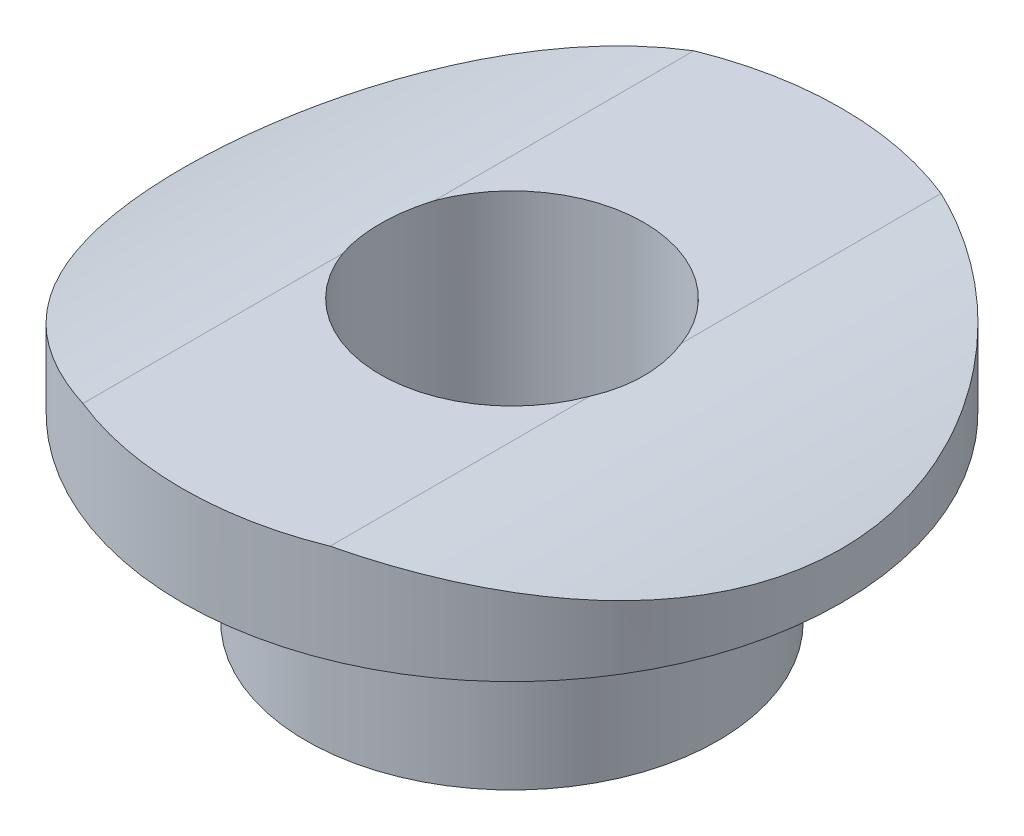
ISO-10303-21;
HEADER;
FILE_DESCRIPTION(('STEP AP214'),'2;1');
FILE_NAME('part.step','',(''),(''),'','','');
FILE_SCHEMA(('AUTOMOTIVE_DESIGN { 1 0 10303 214 1 1 1 1 }'));
ENDSEC;
DATA;
#1=APPLICATION_CONTEXT('core data for automotive mechanical design processes');
#2=APPLICATION_PROTOCOL_DEFINITION('international standard','automotive_design',2000,#1);
#3=PRODUCT_CONTEXT('',#1,'mechanical');
#4=PRODUCT('Part','Part','',(#3));
#5=PRODUCT_RELATED_PRODUCT_CATEGORY('part','',(#4));
#6=PRODUCT_DEFINITION_FORMATION('','',#4);
#7=PRODUCT_DEFINITION_CONTEXT('part definition',#1,'design');
#8=PRODUCT_DEFINITION('design','',#6,#7);
#9=PRODUCT_DEFINITION_SHAPE('','',#8);
#10=(LENGTH_UNIT() NAMED_UNIT(*) SI_UNIT(.MILLI.,.METRE.));
#11=(NAMED_UNIT(*) PLANE_ANGLE_UNIT() SI_UNIT($,.RADIAN.));
#12=(NAMED_UNIT(*) SI_UNIT($,.STERADIAN.) SOLID_ANGLE_UNIT());
#13=UNCERTAINTY_MEASURE_WITH_UNIT(LENGTH_MEASURE(1.E-05),#10,'distance_accuracy_value','');
#14=(GEOMETRIC_REPRESENTATION_CONTEXT(3) GLOBAL_UNCERTAINTY_ASSIGNED_CONTEXT((#13)) GLOBAL_UNIT_ASSIGNED_CONTEXT((#10,
#11,#12)) REPRESENTATION_CONTEXT('',''));
#15=CARTESIAN_POINT('',(0.,0.,0.));
#16=DIRECTION('',(0.,0.,1.));
#17=DIRECTION('',(1.,0.,0.));
#18=AXIS2_PLACEMENT_3D('',#15,#16,#17);
#19=CARTESIAN_POINT('',(0.,0.,0.));
#20=DIRECTION('',(0.,-1.,0.));
#21=DIRECTION('',(0.,0.,-1.));
#22=AXIS2_PLACEMENT_3D('',#19,#20,#21);
#23=CYLINDRICAL_SURFACE('',#22,2.032);
#24=CARTESIAN_POINT('',(0.,0.,0.));
#25=DIRECTION('',(0.,-1.,0.));
#26=DIRECTION('',(0.,0.,-1.));
#27=AXIS2_PLACEMENT_3D('',#24,#25,#26);
#28=CIRCLE('',#27,2.032);
#29=CARTESIAN_POINT('',(0.,0.,-2.032));
#30=VERTEX_POINT('',#29);
#31=EDGE_CURVE('E100',#30,#30,#28,.T.);
#32=ORIENTED_EDGE('',*,*,#31,.T.);
#33=EDGE_LOOP('',(#32));
#34=FACE_BOUND('',#33,.T.);
#35=CARTESIAN_POINT('',(1.90499999999998,4.318,-0.707106074079463));
#36=CARTESIAN_POINT('',(1.92468280374587,4.31536248048454,-0.654076763898529));
#37=CARTESIAN_POINT('',(1.94214605436232,4.31298373032241,-0.600239481785232));
#38=CARTESIAN_POINT('',(1.97253031626523,4.30880097945918,-0.491275480734784));
#39=CARTESIAN_POINT('',(1.98545124783558,4.30699698884496,-0.436148739186172));
#40=CARTESIAN_POINT('',(2.01725914555737,4.30253110728005,-0.269252392804479));
#41=CARTESIAN_POINT('',(2.02916454372759,4.3008189969169,-0.156038641740171));
#42=CARTESIAN_POINT('',(2.0339416193369,4.30013530733765,0.0708074424447846));
#43=CARTESIAN_POINT('',(2.02679888879729,4.30116580262357,0.184440027459384));
#44=CARTESIAN_POINT('',(1.99369467011447,4.30584958324624,0.408626439772084));
#45=CARTESIAN_POINT('',(1.96778773793012,4.30949526476803,0.519188229743194));
#46=CARTESIAN_POINT('',(1.92420082705816,4.31541750222743,0.653676040711907));
#47=CARTESIAN_POINT('',(1.91487884846346,4.31667615233868,0.680502680148397));
#48=CARTESIAN_POINT('',(1.90499999999998,4.318,0.707106074079463));
#49=B_SPLINE_CURVE_WITH_KNOTS('',3,(#35,#36,#37,#38,#39,#40,#41,#42,#43,#44,#45,#46,#47,#48),
.UNSPECIFIED.,.F.,.F.,(4,2,2,2,2,2,4),(0.,0.169773390697426,0.339549760710467,0.679330121992686,
1.01936756556252,1.35842031600887,1.44367590802857),.UNSPECIFIED.);
#50=CARTESIAN_POINT('',(1.90499999999998,4.318,-0.707106074079463));
#51=VERTEX_POINT('',#50);
#52=CARTESIAN_POINT('',(1.90499999999998,4.318,0.707106074079464));
#53=VERTEX_POINT('',#52);
#54=EDGE_CURVE('E74',#51,#53,#49,.T.);
#55=ORIENTED_EDGE('',*,*,#54,.F.);
#56=CARTESIAN_POINT('',(0.,4.318,0.));
#57=DIRECTION('',(0.,-1.,0.));
#58=DIRECTION('',(0.,0.,-1.));
#59=AXIS2_PLACEMENT_3D('',#56,#57,#58);
#60=CIRCLE('',#59,2.032);
#61=CARTESIAN_POINT('',(-1.90499999999998,4.318,-0.707106074079464));
#62=VERTEX_POINT('',#61);
#63=EDGE_CURVE('E120',#62,#51,#60,.T.);
#64=ORIENTED_EDGE('',*,*,#63,.F.);
#65=CARTESIAN_POINT('',(-1.90499999999998,4.318,0.707106074079463));
#66=CARTESIAN_POINT('',(-1.92468280374587,4.31536248048454,0.654076763898529));
#67=CARTESIAN_POINT('',(-1.94214605436232,4.31298373032241,0.600239481785232));
#68=CARTESIAN_POINT('',(-1.97253031626523,4.30880097945918,0.491275480734784));
#69=CARTESIAN_POINT('',(-1.98545124783558,4.30699698884496,0.436148739186172));
#70=CARTESIAN_POINT('',(-2.01725914555737,4.30253110728005,0.269252392804479));
#71=CARTESIAN_POINT('',(-2.02916454372759,4.3008189969169,0.156038641740171));
#72=CARTESIAN_POINT('',(-2.0339416193369,4.30013530733765,-0.0708074424447846));
#73=CARTESIAN_POINT('',(-2.02679888879729,4.30116580262357,-0.184440027459384));
#74=CARTESIAN_POINT('',(-1.99369467011447,4.30584958324624,-0.408626439772084));
#75=CARTESIAN_POINT('',(-1.96778773793012,4.30949526476803,-0.519188229743194));
#76=CARTESIAN_POINT('',(-1.92420082705816,4.31541750222743,-0.653676040711907));
#77=CARTESIAN_POINT('',(-1.91487884846346,4.31667615233868,-0.680502680148397));
#78=CARTESIAN_POINT('',(-1.90499999999998,4.318,-0.707106074079463));
#79=B_SPLINE_CURVE_WITH_KNOTS('',3,(#65,#66,#67,#68,#69,#70,#71,#72,#73,#74,#75,#76,#77,#78),
.UNSPECIFIED.,.F.,.F.,(4,2,2,2,2,2,4),(0.,0.169773390697426,0.339549760710467,0.679330121992686,
1.01936756556252,1.35842031600887,1.44367590802857),.UNSPECIFIED.);
#80=CARTESIAN_POINT('',(-1.90499999999998,4.318,0.707106074079463));
#81=VERTEX_POINT('',#80);
#82=EDGE_CURVE('E67',#81,#62,#79,.T.);
#83=ORIENTED_EDGE('',*,*,#82,.F.);
#84=EDGE_CURVE('E114',#53,#81,#60,.T.);
#85=ORIENTED_EDGE('',*,*,#84,.F.);
#86=EDGE_LOOP('',(#55,#64,#83,#85));
#87=FACE_BOUND('',#86,.T.);
#88=ADVANCED_FACE('F51',(#34,#87),#23,.F.);
#89=CARTESIAN_POINT('',(0.,0.,0.));
#90=DIRECTION('',(0.,-1.,0.));
#91=DIRECTION('',(0.,0.,-1.));
#92=AXIS2_PLACEMENT_3D('',#89,#90,#91);
#93=CYLINDRICAL_SURFACE('',#92,5.08);
#94=CARTESIAN_POINT('',(0.,2.794,0.));
#95=DIRECTION('',(0.,-1.,0.));
#96=DIRECTION('',(0.,0.,-1.));
#97=AXIS2_PLACEMENT_3D('',#94,#95,#96);
#98=CIRCLE('',#97,5.08);
#99=CARTESIAN_POINT('',(0.,2.794,-5.08));
#100=VERTEX_POINT('',#99);
#101=EDGE_CURVE('E118',#100,#100,#98,.T.);
#102=ORIENTED_EDGE('',*,*,#101,.F.);
#103=EDGE_LOOP('',(#102));
#104=FACE_BOUND('',#103,.T.);
#105=CARTESIAN_POINT('',(1.90499999999998,4.318,4.70928603930575));
#106=CARTESIAN_POINT('',(2.03903667969095,4.30006177793964,4.6550778977629));
#107=CARTESIAN_POINT('',(2.17054123721565,4.28050811513206,4.59521121756992));
#108=CARTESIAN_POINT('',(2.42762275183672,4.23877657144714,4.46472741078724));
#109=CARTESIAN_POINT('',(2.5532014392052,4.21659946329542,4.39411344802024));
#110=CARTESIAN_POINT('',(2.79752810439003,4.17023911773298,4.24274323526789));
#111=CARTESIAN_POINT('',(2.9162826399775,4.14605786273545,4.16199696800147));
#112=CARTESIAN_POINT('',(3.14633966757798,4.09634312461087,3.99092954699728));
#113=CARTESIAN_POINT('',(3.25764169321642,4.07080955703548,3.90060779494221));
#114=CARTESIAN_POINT('',(3.57920320939398,3.99324398906486,3.6162684171993));
#115=CARTESIAN_POINT('',(3.77747767566447,3.94017571221332,3.40865310250046));
#116=CARTESIAN_POINT('',(4.13657144510587,3.83718148651851,2.96264398311337));
#117=CARTESIAN_POINT('',(4.29738470758164,3.78725604540977,2.72424522415242));
#118=CARTESIAN_POINT('',(4.57866441801997,3.69580870577338,2.21957516435603));
#119=CARTESIAN_POINT('',(4.6986682951404,3.65438513508646,1.9530264741257));
#120=CARTESIAN_POINT('',(4.89152005742993,3.58602864323014,1.40165494620108));
#121=CARTESIAN_POINT('',(4.96438952340127,3.55908909141185,1.11684053733641));
#122=CARTESIAN_POINT('',(5.05756313025242,3.52436171603635,0.552375525300156));
#123=CARTESIAN_POINT('',(5.08032818837416,3.51567826653354,0.273186436913899));
#124=CARTESIAN_POINT('',(5.07966483357338,3.51593076403133,-0.28509483415444));
#125=CARTESIAN_POINT('',(5.05624626164081,3.52486295742133,-0.564187024809562));
#126=CARTESIAN_POINT('',(4.96609931801238,3.55844155208552,-1.1026389792522));
#127=CARTESIAN_POINT('',(4.90114809621265,3.5824424435153,-1.36234106681154));
#128=CARTESIAN_POINT('',(4.73194874211682,3.64272178077546,-1.86706217618957));
#129=CARTESIAN_POINT('',(4.62769701286369,3.67900135037395,-2.11207985164594));
#130=CARTESIAN_POINT('',(4.37879867886377,3.76129867239987,-2.58991158606701));
#131=CARTESIAN_POINT('',(4.23287666409112,3.80761048960784,-2.82200782870113));
#132=CARTESIAN_POINT('',(3.90596021530326,3.90427255949954,-3.25951617355728));
#133=CARTESIAN_POINT('',(3.72493472776384,3.95462636455443,-3.46490437834497));
#134=CARTESIAN_POINT('',(3.42499091082858,4.03071881079313,-3.75455523520295));
#135=CARTESIAN_POINT('',(3.31701073551321,4.05687397237243,-3.85028330293088));
#136=CARTESIAN_POINT('',(3.09316490436248,4.10816040017171,-4.03230816726997));
#137=CARTESIAN_POINT('',(2.97730209817658,4.13329203121079,-4.11860834306679));
#138=CARTESIAN_POINT('',(2.73865694486141,4.18178773623427,-4.28099952043123));
#139=CARTESIAN_POINT('',(2.61588953117569,4.20515538688807,-4.35711143631233));
#140=CARTESIAN_POINT('',(2.36403768420495,4.24952338799088,-4.49872985361908));
#141=CARTESIAN_POINT('',(2.23495670380526,4.27052501210889,-4.56424206939363));
#142=CARTESIAN_POINT('',(2.03775559018694,4.299743714764,-4.65393684524195));
#143=CARTESIAN_POINT('',(1.97168350705387,4.30907143396539,-4.6823142294754));
#144=CARTESIAN_POINT('',(1.90499999999998,4.318,-4.70928603930575));
#145=B_SPLINE_CURVE_WITH_KNOTS('',3,(#105,#106,#107,#108,#109,#110,#111,#112,#113,#114,#115,
#116,#117,#118,#119,#120,#121,#122,#123,#124,#125,#126,#127,#128,#129,#130,#131,#132,#133,#134,
#135,#136,#137,#138,#139,#140,#141,#142,#143,#144),.UNSPECIFIED.,.F.,.F.,(4,2,2,2,2,2,2,2,2,2,2,
2,2,2,2,2,2,2,2,4),(0.,0.436897475580579,0.873666583636317,1.310008700559,1.74637809809413,
2.61784469036652,3.48945171127074,4.37063245558511,5.25140945934249,6.08785908446504,
6.92413049486237,7.72681616719873,8.52957532273734,9.36017173431382,10.1915062948372,
10.6310389405339,11.0704135265651,11.5088718670745,11.9470930392798,12.1645541887048),.UNSPECIFIED.);
#146=CARTESIAN_POINT('',(1.90499999999998,4.318,4.70928603930575));
#147=VERTEX_POINT('',#146);
#148=CARTESIAN_POINT('',(1.90499999999998,4.318,-4.70928603930575));
#149=VERTEX_POINT('',#148);
#150=EDGE_CURVE('E175',#147,#149,#145,.T.);
#151=ORIENTED_EDGE('',*,*,#150,.F.);
#152=CARTESIAN_POINT('',(0.,4.318,0.));
#153=DIRECTION('',(0.,-1.,0.));
#154=DIRECTION('',(0.,0.,-1.));
#155=AXIS2_PLACEMENT_3D('',#152,#153,#154);
#156=CIRCLE('',#155,5.08);
#157=CARTESIAN_POINT('',(-1.90499999999998,4.318,4.70928603930575));
#158=VERTEX_POINT('',#157);
#159=EDGE_CURVE('E108',#147,#158,#156,.T.);
#160=ORIENTED_EDGE('',*,*,#159,.T.);
#161=CARTESIAN_POINT('',(-1.90499999999998,4.318,-4.70928603930575));
#162=CARTESIAN_POINT('',(-2.03903667969095,4.30006177793964,-4.6550778977629));
#163=CARTESIAN_POINT('',(-2.17054123721565,4.28050811513206,-4.59521121756992));
#164=CARTESIAN_POINT('',(-2.42762275183672,4.23877657144714,-4.46472741078724));
#165=CARTESIAN_POINT('',(-2.5532014392052,4.21659946329542,-4.39411344802024));
#166=CARTESIAN_POINT('',(-2.79752810439003,4.17023911773298,-4.24274323526789));
#167=CARTESIAN_POINT('',(-2.9162826399775,4.14605786273545,-4.16199696800147));
#168=CARTESIAN_POINT('',(-3.14633966757798,4.09634312461087,-3.99092954699728));
#169=CARTESIAN_POINT('',(-3.25764169321642,4.07080955703548,-3.90060779494221));
#170=CARTESIAN_POINT('',(-3.57920320939398,3.99324398906486,-3.6162684171993));
#171=CARTESIAN_POINT('',(-3.77747767566447,3.94017571221332,-3.40865310250046));
#172=CARTESIAN_POINT('',(-4.13657144510587,3.83718148651851,-2.96264398311337));
#173=CARTESIAN_POINT('',(-4.29738470758164,3.78725604540977,-2.72424522415242));
#174=CARTESIAN_POINT('',(-4.57866441801997,3.69580870577338,-2.21957516435603));
#175=CARTESIAN_POINT('',(-4.6986682951404,3.65438513508646,-1.9530264741257));
#176=CARTESIAN_POINT('',(-4.89152005742993,3.58602864323014,-1.40165494620108));
#177=CARTESIAN_POINT('',(-4.96438952340127,3.55908909141185,-1.11684053733641));
#178=CARTESIAN_POINT('',(-5.05756313025242,3.52436171603635,-0.552375525300156));
#179=CARTESIAN_POINT('',(-5.08032818837416,3.51567826653354,-0.273186436913899));
#180=CARTESIAN_POINT('',(-5.07966483357338,3.51593076403133,0.28509483415444));
#181=CARTESIAN_POINT('',(-5.05624626164081,3.52486295742133,0.564187024809562));
#182=CARTESIAN_POINT('',(-4.96609931801238,3.55844155208552,1.1026389792522));
#183=CARTESIAN_POINT('',(-4.90114809621265,3.5824424435153,1.36234106681154));
#184=CARTESIAN_POINT('',(-4.73194874211682,3.64272178077546,1.86706217618957));
#185=CARTESIAN_POINT('',(-4.62769701286369,3.67900135037395,2.11207985164594));
#186=CARTESIAN_POINT('',(-4.37879867886377,3.76129867239987,2.58991158606701));
#187=CARTESIAN_POINT('',(-4.23287666409112,3.80761048960784,2.82200782870113));
#188=CARTESIAN_POINT('',(-3.90596021530326,3.90427255949954,3.25951617355728));
#189=CARTESIAN_POINT('',(-3.72493472776384,3.95462636455443,3.46490437834497));
#190=CARTESIAN_POINT('',(-3.42499091082858,4.03071881079313,3.75455523520295));
#191=CARTESIAN_POINT('',(-3.31701073551321,4.05687397237243,3.85028330293088));
#192=CARTESIAN_POINT('',(-3.09316490436248,4.10816040017171,4.03230816726997));
#193=CARTESIAN_POINT('',(-2.97730209817658,4.13329203121079,4.11860834306679));
#194=CARTESIAN_POINT('',(-2.73865694486141,4.18178773623427,4.28099952043123));
#195=CARTESIAN_POINT('',(-2.61588953117569,4.20515538688807,4.35711143631233));
#196=CARTESIAN_POINT('',(-2.36403768420495,4.24952338799088,4.49872985361908));
#197=CARTESIAN_POINT('',(-2.23495670380526,4.27052501210889,4.56424206939363));
#198=CARTESIAN_POINT('',(-2.03775559018694,4.299743714764,4.65393684524195));
#199=CARTESIAN_POINT('',(-1.97168350705387,4.30907143396539,4.6823142294754));
#200=CARTESIAN_POINT('',(-1.90499999999998,4.318,4.70928603930575));
#201=B_SPLINE_CURVE_WITH_KNOTS('',3,(#161,#162,#163,#164,#165,#166,#167,#168,#169,#170,#171,
#172,#173,#174,#175,#176,#177,#178,#179,#180,#181,#182,#183,#184,#185,#186,#187,#188,#189,#190,
#191,#192,#193,#194,#195,#196,#197,#198,#199,#200),.UNSPECIFIED.,.F.,.F.,(4,2,2,2,2,2,2,2,2,2,2,
2,2,2,2,2,2,2,2,4),(0.,0.436897475580579,0.873666583636317,1.310008700559,1.74637809809413,
2.61784469036652,3.48945171127074,4.37063245558511,5.25140945934249,6.08785908446504,
6.92413049486237,7.72681616719873,8.52957532273734,9.36017173431382,10.1915062948372,
10.6310389405339,11.0704135265651,11.5088718670745,11.9470930392798,12.1645541887048),.UNSPECIFIED.);
#202=CARTESIAN_POINT('',(-1.90499999999998,4.318,-4.70928603930575));
#203=VERTEX_POINT('',#202);
#204=EDGE_CURVE('E92',#203,#158,#201,.T.);
#205=ORIENTED_EDGE('',*,*,#204,.F.);
#206=EDGE_CURVE('E106',#203,#149,#156,.T.);
#207=ORIENTED_EDGE('',*,*,#206,.T.);
#208=EDGE_LOOP('',(#151,#160,#205,#207));
#209=FACE_BOUND('',#208,.T.);
#210=ADVANCED_FACE('F105',(#104,#209),#93,.T.);
#211=CARTESIAN_POINT('',(-5.08,4.318,0.));
#212=DIRECTION('',(0.,-1.,0.));
#213=DIRECTION('',(0.,0.,-1.));
#214=AXIS2_PLACEMENT_3D('',#211,#212,#213);
#215=PLANE('',#214);
#216=DIRECTION('',(0.,0.,1.));
#217=VECTOR('',#216,1.);
#218=CARTESIAN_POINT('',(1.90499999999998,4.318,-5.08));
#219=LINE('',#218,#217);
#220=EDGE_CURVE('E12',#149,#51,#219,.T.);
#221=ORIENTED_EDGE('',*,*,#220,.F.);
#222=ORIENTED_EDGE('',*,*,#206,.F.);
#223=DIRECTION('',(0.,0.,1.));
#224=VECTOR('',#223,1.);
#225=CARTESIAN_POINT('',(-1.90499999999998,4.318,-5.08));
#226=LINE('',#225,#224);
#227=EDGE_CURVE('E89',#62,#203,#226,.F.);
#228=ORIENTED_EDGE('',*,*,#227,.F.);
#229=ORIENTED_EDGE('',*,*,#63,.T.);
#230=EDGE_LOOP('',(#221,#222,#228,#229));
#231=FACE_BOUND('',#230,.T.);
#232=ADVANCED_FACE('F112',(#231),#215,.F.);
#233=EDGE_CURVE('E55',#53,#147,#219,.T.);
#234=ORIENTED_EDGE('',*,*,#233,.F.);
#235=ORIENTED_EDGE('',*,*,#84,.T.);
#236=EDGE_CURVE('E99',#158,#81,#226,.F.);
#237=ORIENTED_EDGE('',*,*,#236,.F.);
#238=ORIENTED_EDGE('',*,*,#159,.F.);
#239=EDGE_LOOP('',(#234,#235,#237,#238));
#240=FACE_BOUND('',#239,.T.);
#241=ADVANCED_FACE('F145',(#240),#215,.F.);
#242=CARTESIAN_POINT('',(-2.032,0.,0.));
#243=DIRECTION('',(0.,1.,0.));
#244=DIRECTION('',(0.,0.,1.));
#245=AXIS2_PLACEMENT_3D('',#242,#243,#244);
#246=PLANE('',#245);
#247=ORIENTED_EDGE('',*,*,#31,.F.);
#248=EDGE_LOOP('',(#247));
#249=FACE_BOUND('',#248,.T.);
#250=CARTESIAN_POINT('',(0.,0.,0.));
#251=DIRECTION('',(0.,-1.,0.));
#252=DIRECTION('',(0.,0.,-1.));
#253=AXIS2_PLACEMENT_3D('',#250,#251,#252);
#254=CIRCLE('',#253,3.175);
#255=CARTESIAN_POINT('',(0.,0.,-3.175));
#256=VERTEX_POINT('',#255);
#257=EDGE_CURVE('E131',#256,#256,#254,.T.);
#258=ORIENTED_EDGE('',*,*,#257,.T.);
#259=EDGE_LOOP('',(#258));
#260=FACE_BOUND('',#259,.T.);
#261=ADVANCED_FACE('F141',(#249,#260),#246,.F.);
#262=CARTESIAN_POINT('',(0.,0.,0.));
#263=DIRECTION('',(0.,-1.,0.));
#264=DIRECTION('',(0.,0.,-1.));
#265=AXIS2_PLACEMENT_3D('',#262,#263,#264);
#266=CYLINDRICAL_SURFACE('',#265,3.175);
#267=ORIENTED_EDGE('',*,*,#257,.F.);
#268=EDGE_LOOP('',(#267));
#269=FACE_BOUND('',#268,.T.);
#270=CARTESIAN_POINT('',(0.,2.794,0.));
#271=DIRECTION('',(0.,-1.,0.));
#272=DIRECTION('',(0.,0.,-1.));
#273=AXIS2_PLACEMENT_3D('',#270,#271,#272);
#274=CIRCLE('',#273,3.175);
#275=CARTESIAN_POINT('',(0.,2.794,-3.175));
#276=VERTEX_POINT('',#275);
#277=EDGE_CURVE('E127',#276,#276,#274,.T.);
#278=ORIENTED_EDGE('',*,*,#277,.T.);
#279=EDGE_LOOP('',(#278));
#280=FACE_BOUND('',#279,.T.);
#281=ADVANCED_FACE('F144',(#269,#280),#266,.T.);
#282=CARTESIAN_POINT('',(-3.175,2.794,0.));
#283=DIRECTION('',(0.,1.,0.));
#284=DIRECTION('',(0.,0.,1.));
#285=AXIS2_PLACEMENT_3D('',#282,#283,#284);
#286=PLANE('',#285);
#287=ORIENTED_EDGE('',*,*,#277,.F.);
#288=EDGE_LOOP('',(#287));
#289=FACE_BOUND('',#288,.T.);
#290=ORIENTED_EDGE('',*,*,#101,.T.);
#291=EDGE_LOOP('',(#290));
#292=FACE_BOUND('',#291,.T.);
#293=ADVANCED_FACE('F150',(#289,#292),#286,.F.);
#294=CARTESIAN_POINT('',(0.,-9.906,-5.08));
#295=DIRECTION('',(0.,0.,1.));
#296=DIRECTION('',(1.,0.,0.));
#297=AXIS2_PLACEMENT_3D('',#294,#295,#296);
#298=CYLINDRICAL_SURFACE('',#297,14.351);
#299=ORIENTED_EDGE('',*,*,#236,.T.);
#300=ORIENTED_EDGE('',*,*,#82,.T.);
#301=ORIENTED_EDGE('',*,*,#227,.T.);
#302=ORIENTED_EDGE('',*,*,#204,.T.);
#303=EDGE_LOOP('',(#299,#300,#301,#302));
#304=FACE_BOUND('',#303,.T.);
#305=ADVANCED_FACE('F91',(#304),#298,.T.);
#306=ORIENTED_EDGE('',*,*,#220,.T.);
#307=ORIENTED_EDGE('',*,*,#54,.T.);
#308=ORIENTED_EDGE('',*,*,#233,.T.);
#309=ORIENTED_EDGE('',*,*,#150,.T.);
#310=EDGE_LOOP('',(#306,#307,#308,#309));
#311=FACE_BOUND('',#310,.T.);
#312=ADVANCED_FACE('F189',(#311),#298,.T.);
#313=CLOSED_SHELL('',(#88,#210,#232,#241,#261,#281,#293,#305,#312));
#314=MANIFOLD_SOLID_BREP('B2',#313);
#315=ADVANCED_BREP_SHAPE_REPRESENTATION('',(#18,#314),#14);
#316=SHAPE_DEFINITION_REPRESENTATION(#9,#315);
ENDSEC;
END-ISO-10303-21;
